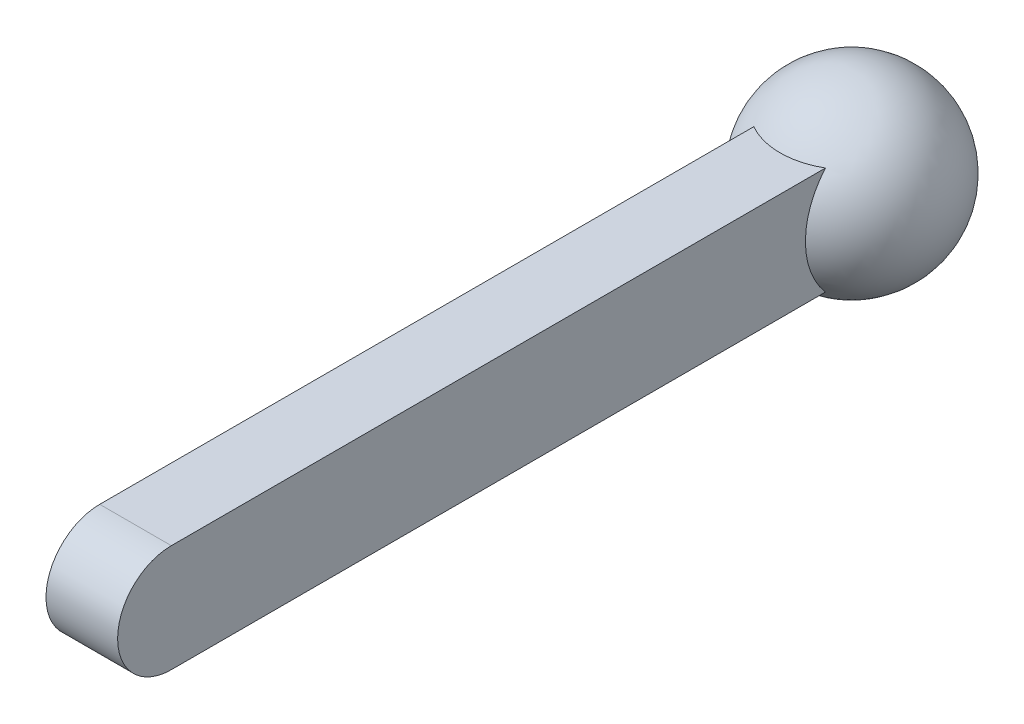
ISO-10303-21;
HEADER;
FILE_DESCRIPTION(('STEP AP214'),'2;1');
FILE_NAME('part.step','',(''),(''),'','','');
FILE_SCHEMA(('AUTOMOTIVE_DESIGN { 1 0 10303 214 1 1 1 1 }'));
ENDSEC;
DATA;
#1=APPLICATION_CONTEXT('core data for automotive mechanical design processes');
#2=APPLICATION_PROTOCOL_DEFINITION('international standard','automotive_design',2000,#1);
#3=PRODUCT_CONTEXT('',#1,'mechanical');
#4=PRODUCT('Part','Part','',(#3));
#5=PRODUCT_RELATED_PRODUCT_CATEGORY('part','',(#4));
#6=PRODUCT_DEFINITION_FORMATION('','',#4);
#7=PRODUCT_DEFINITION_CONTEXT('part definition',#1,'design');
#8=PRODUCT_DEFINITION('design','',#6,#7);
#9=PRODUCT_DEFINITION_SHAPE('','',#8);
#10=(LENGTH_UNIT() NAMED_UNIT(*) SI_UNIT(.MILLI.,.METRE.));
#11=(NAMED_UNIT(*) PLANE_ANGLE_UNIT() SI_UNIT($,.RADIAN.));
#12=(NAMED_UNIT(*) SI_UNIT($,.STERADIAN.) SOLID_ANGLE_UNIT());
#13=UNCERTAINTY_MEASURE_WITH_UNIT(LENGTH_MEASURE(1.E-05),#10,'distance_accuracy_value','');
#14=(GEOMETRIC_REPRESENTATION_CONTEXT(3) GLOBAL_UNCERTAINTY_ASSIGNED_CONTEXT((#13)) GLOBAL_UNIT_ASSIGNED_CONTEXT((#10,
#11,#12)) REPRESENTATION_CONTEXT('',''));
#15=CARTESIAN_POINT('',(0.,0.,0.));
#16=DIRECTION('',(0.,0.,1.));
#17=DIRECTION('',(1.,0.,0.));
#18=AXIS2_PLACEMENT_3D('',#15,#16,#17);
#19=CARTESIAN_POINT('',(10.,0.,0.));
#20=DIRECTION('',(-1.,0.,0.));
#21=DIRECTION('',(0.,0.,1.));
#22=AXIS2_PLACEMENT_3D('',#19,#20,#21);
#23=CYLINDRICAL_SURFACE('',#22,15.);
#24=CARTESIAN_POINT('',(-10.,0.,0.));
#25=DIRECTION('',(1.,0.,0.));
#26=DIRECTION('',(0.,0.,-1.));
#27=AXIS2_PLACEMENT_3D('',#24,#25,#26);
#28=CIRCLE('',#27,15.);
#29=CARTESIAN_POINT('',(-10.,15.,0.));
#30=VERTEX_POINT('',#29);
#31=CARTESIAN_POINT('',(-10.,-15.,0.));
#32=VERTEX_POINT('',#31);
#33=EDGE_CURVE('E80',#30,#32,#28,.T.);
#34=ORIENTED_EDGE('',*,*,#33,.T.);
#35=DIRECTION('',(-1.,0.,0.));
#36=VECTOR('',#35,1.);
#37=CARTESIAN_POINT('',(10.,-15.,0.));
#38=LINE('',#37,#36);
#39=CARTESIAN_POINT('',(10.,-15.,0.));
#40=VERTEX_POINT('',#39);
#41=EDGE_CURVE('E43',#40,#32,#38,.T.);
#42=ORIENTED_EDGE('',*,*,#41,.F.);
#43=CARTESIAN_POINT('',(10.,0.,0.));
#44=DIRECTION('',(1.,0.,0.));
#45=DIRECTION('',(0.,0.,-1.));
#46=AXIS2_PLACEMENT_3D('',#43,#44,#45);
#47=CIRCLE('',#46,15.);
#48=CARTESIAN_POINT('',(10.,15.,0.));
#49=VERTEX_POINT('',#48);
#50=EDGE_CURVE('E84',#49,#40,#47,.T.);
#51=ORIENTED_EDGE('',*,*,#50,.F.);
#52=DIRECTION('',(-1.,0.,0.));
#53=VECTOR('',#52,1.);
#54=CARTESIAN_POINT('',(10.,15.,0.));
#55=LINE('',#54,#53);
#56=EDGE_CURVE('E102',#49,#30,#55,.T.);
#57=ORIENTED_EDGE('',*,*,#56,.T.);
#58=EDGE_LOOP('',(#34,#42,#51,#57));
#59=FACE_BOUND('',#58,.T.);
#60=ADVANCED_FACE('F36',(#59),#23,.T.);
#61=CARTESIAN_POINT('',(10.,-15.,0.));
#62=DIRECTION('',(0.,1.,0.));
#63=DIRECTION('',(0.,0.,1.));
#64=AXIS2_PLACEMENT_3D('',#61,#62,#63);
#65=PLANE('',#64);
#66=CARTESIAN_POINT('',(0.,-15.,-200.));
#67=DIRECTION('',(0.,1.,0.));
#68=DIRECTION('',(0.,0.,1.));
#69=AXIS2_PLACEMENT_3D('',#66,#67,#68);
#70=CIRCLE('',#69,20.);
#71=CARTESIAN_POINT('',(10.,-15.,-182.679491924311));
#72=VERTEX_POINT('',#71);
#73=CARTESIAN_POINT('',(-10.,-15.,-182.679491924311));
#74=VERTEX_POINT('',#73);
#75=EDGE_CURVE('E58',#72,#74,#70,.F.);
#76=ORIENTED_EDGE('',*,*,#75,.F.);
#77=DIRECTION('',(0.,0.,-1.));
#78=VECTOR('',#77,1.);
#79=CARTESIAN_POINT('',(10.,-15.,0.));
#80=LINE('',#79,#78);
#81=EDGE_CURVE('E99',#40,#72,#80,.T.);
#82=ORIENTED_EDGE('',*,*,#81,.F.);
#83=ORIENTED_EDGE('',*,*,#41,.T.);
#84=DIRECTION('',(0.,0.,-1.));
#85=VECTOR('',#84,1.);
#86=CARTESIAN_POINT('',(-10.,-15.,0.));
#87=LINE('',#86,#85);
#88=EDGE_CURVE('E85',#32,#74,#87,.T.);
#89=ORIENTED_EDGE('',*,*,#88,.T.);
#90=EDGE_LOOP('',(#76,#82,#83,#89));
#91=FACE_BOUND('',#90,.T.);
#92=ADVANCED_FACE('F107',(#91),#65,.F.);
#93=CARTESIAN_POINT('',(10.,15.,0.));
#94=DIRECTION('',(0.,-1.,0.));
#95=DIRECTION('',(0.,0.,-1.));
#96=AXIS2_PLACEMENT_3D('',#93,#94,#95);
#97=PLANE('',#96);
#98=CARTESIAN_POINT('',(0.,15.,-200.));
#99=DIRECTION('',(0.,-1.,0.));
#100=DIRECTION('',(0.,0.,-1.));
#101=AXIS2_PLACEMENT_3D('',#98,#99,#100);
#102=CIRCLE('',#101,20.);
#103=CARTESIAN_POINT('',(-10.,15.,-182.679491924311));
#104=VERTEX_POINT('',#103);
#105=CARTESIAN_POINT('',(10.,15.,-182.679491924311));
#106=VERTEX_POINT('',#105);
#107=EDGE_CURVE('E88',#104,#106,#102,.F.);
#108=ORIENTED_EDGE('',*,*,#107,.F.);
#109=DIRECTION('',(0.,0.,1.));
#110=VECTOR('',#109,1.);
#111=CARTESIAN_POINT('',(-10.,15.,0.));
#112=LINE('',#111,#110);
#113=EDGE_CURVE('E76',#104,#30,#112,.T.);
#114=ORIENTED_EDGE('',*,*,#113,.T.);
#115=ORIENTED_EDGE('',*,*,#56,.F.);
#116=DIRECTION('',(0.,0.,1.));
#117=VECTOR('',#116,1.);
#118=CARTESIAN_POINT('',(10.,15.,0.));
#119=LINE('',#118,#117);
#120=EDGE_CURVE('E90',#106,#49,#119,.T.);
#121=ORIENTED_EDGE('',*,*,#120,.F.);
#122=EDGE_LOOP('',(#108,#114,#115,#121));
#123=FACE_BOUND('',#122,.T.);
#124=ADVANCED_FACE('F89',(#123),#97,.F.);
#125=CARTESIAN_POINT('',(10.,0.,0.));
#126=DIRECTION('',(1.,0.,0.));
#127=DIRECTION('',(0.,0.,-1.));
#128=AXIS2_PLACEMENT_3D('',#125,#126,#127);
#129=PLANE('',#128);
#130=ORIENTED_EDGE('',*,*,#81,.T.);
#131=CARTESIAN_POINT('',(10.,0.,-200.));
#132=DIRECTION('',(1.,0.,0.));
#133=DIRECTION('',(0.,0.,-1.));
#134=AXIS2_PLACEMENT_3D('',#131,#132,#133);
#135=CIRCLE('',#134,22.9128784747792);
#136=EDGE_CURVE('E50',#72,#106,#135,.F.);
#137=ORIENTED_EDGE('',*,*,#136,.T.);
#138=ORIENTED_EDGE('',*,*,#120,.T.);
#139=ORIENTED_EDGE('',*,*,#50,.T.);
#140=EDGE_LOOP('',(#130,#137,#138,#139));
#141=FACE_BOUND('',#140,.T.);
#142=ADVANCED_FACE('F110',(#141),#129,.T.);
#143=CARTESIAN_POINT('',(-10.,0.,0.));
#144=DIRECTION('',(1.,0.,0.));
#145=DIRECTION('',(0.,0.,-1.));
#146=AXIS2_PLACEMENT_3D('',#143,#144,#145);
#147=PLANE('',#146);
#148=CARTESIAN_POINT('',(-10.,0.,-200.));
#149=DIRECTION('',(1.,0.,0.));
#150=DIRECTION('',(0.,0.,-1.));
#151=AXIS2_PLACEMENT_3D('',#148,#149,#150);
#152=CIRCLE('',#151,22.9128784747792);
#153=EDGE_CURVE('E11',#74,#104,#152,.F.);
#154=ORIENTED_EDGE('',*,*,#153,.F.);
#155=ORIENTED_EDGE('',*,*,#88,.F.);
#156=ORIENTED_EDGE('',*,*,#33,.F.);
#157=ORIENTED_EDGE('',*,*,#113,.F.);
#158=EDGE_LOOP('',(#154,#155,#156,#157));
#159=FACE_BOUND('',#158,.T.);
#160=ADVANCED_FACE('F78',(#159),#147,.F.);
#161=CARTESIAN_POINT('',(0.,0.,-200.));
#162=DIRECTION('',(0.,1.,0.));
#163=DIRECTION('',(0.,0.,-1.));
#164=AXIS2_PLACEMENT_3D('',#161,#162,#163);
#165=SPHERICAL_SURFACE('',#164,25.);
#166=ORIENTED_EDGE('',*,*,#136,.F.);
#167=ORIENTED_EDGE('',*,*,#75,.T.);
#168=ORIENTED_EDGE('',*,*,#153,.T.);
#169=ORIENTED_EDGE('',*,*,#107,.T.);
#170=EDGE_LOOP('',(#166,#167,#168,#169));
#171=FACE_BOUND('',#170,.T.);
#172=ADVANCED_FACE('F93',(#171),#165,.T.);
#173=CLOSED_SHELL('',(#60,#92,#124,#142,#160,#172));
#174=MANIFOLD_SOLID_BREP('B2',#173);
#175=ADVANCED_BREP_SHAPE_REPRESENTATION('',(#18,#174),#14);
#176=SHAPE_DEFINITION_REPRESENTATION(#9,#175);
ENDSEC;
END-ISO-10303-21;
